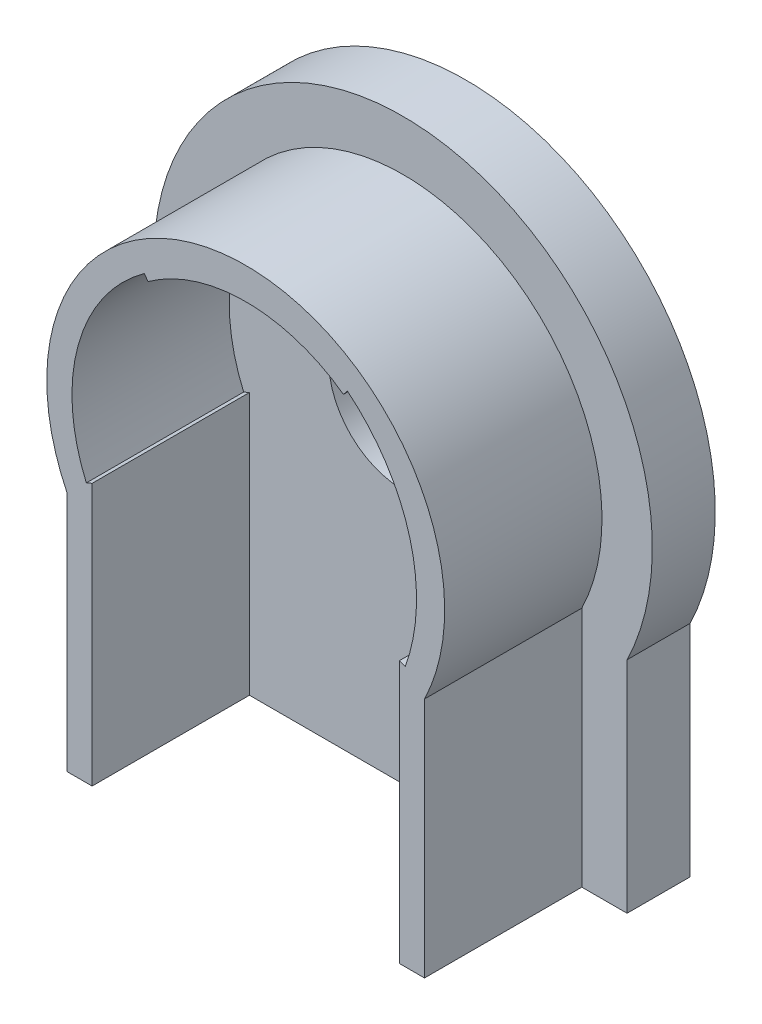
ISO-10303-21;
HEADER;
FILE_DESCRIPTION(('STEP AP214'),'2;1');
FILE_NAME('part.step','',(''),(''),'','','');
FILE_SCHEMA(('AUTOMOTIVE_DESIGN { 1 0 10303 214 1 1 1 1 }'));
ENDSEC;
DATA;
#1=APPLICATION_CONTEXT('core data for automotive mechanical design processes');
#2=APPLICATION_PROTOCOL_DEFINITION('international standard','automotive_design',2000,#1);
#3=PRODUCT_CONTEXT('',#1,'mechanical');
#4=PRODUCT('Part','Part','',(#3));
#5=PRODUCT_RELATED_PRODUCT_CATEGORY('part','',(#4));
#6=PRODUCT_DEFINITION_FORMATION('','',#4);
#7=PRODUCT_DEFINITION_CONTEXT('part definition',#1,'design');
#8=PRODUCT_DEFINITION('design','',#6,#7);
#9=PRODUCT_DEFINITION_SHAPE('','',#8);
#10=(LENGTH_UNIT() NAMED_UNIT(*) SI_UNIT(.MILLI.,.METRE.));
#11=(NAMED_UNIT(*) PLANE_ANGLE_UNIT() SI_UNIT($,.RADIAN.));
#12=(NAMED_UNIT(*) SI_UNIT($,.STERADIAN.) SOLID_ANGLE_UNIT());
#13=UNCERTAINTY_MEASURE_WITH_UNIT(LENGTH_MEASURE(1.E-05),#10,'distance_accuracy_value','');
#14=(GEOMETRIC_REPRESENTATION_CONTEXT(3) GLOBAL_UNCERTAINTY_ASSIGNED_CONTEXT((#13)) GLOBAL_UNIT_ASSIGNED_CONTEXT((#10,
#11,#12)) REPRESENTATION_CONTEXT('',''));
#15=CARTESIAN_POINT('',(0.,0.,0.));
#16=DIRECTION('',(0.,0.,1.));
#17=DIRECTION('',(1.,0.,0.));
#18=AXIS2_PLACEMENT_3D('',#15,#16,#17);
#19=CARTESIAN_POINT('',(9.02,0.,7.9375));
#20=DIRECTION('',(-1.,0.,0.));
#21=DIRECTION('',(0.,0.,1.));
#22=AXIS2_PLACEMENT_3D('',#19,#20,#21);
#23=PLANE('',#22);
#24=DIRECTION('',(0.,1.,0.));
#25=VECTOR('',#24,1.);
#26=CARTESIAN_POINT('',(9.02,0.,0.));
#27=LINE('',#26,#25);
#28=CARTESIAN_POINT('',(9.02,-16.5939489974442,0.));
#29=VERTEX_POINT('',#28);
#30=CARTESIAN_POINT('',(9.02,-4.4019489974442,0.));
#31=VERTEX_POINT('',#30);
#32=EDGE_CURVE('E283',#29,#31,#27,.T.);
#33=ORIENTED_EDGE('',*,*,#32,.T.);
#34=DIRECTION('',(0.,0.,-1.));
#35=VECTOR('',#34,1.);
#36=CARTESIAN_POINT('',(9.02,-4.4019489974442,7.9375));
#37=LINE('',#36,#35);
#38=CARTESIAN_POINT('',(9.02,-4.4019489974442,7.9375));
#39=VERTEX_POINT('',#38);
#40=EDGE_CURVE('E11',#39,#31,#37,.T.);
#41=ORIENTED_EDGE('',*,*,#40,.F.);
#42=DIRECTION('',(0.,1.,0.));
#43=VECTOR('',#42,1.);
#44=CARTESIAN_POINT('',(9.02,0.,7.9375));
#45=LINE('',#44,#43);
#46=CARTESIAN_POINT('',(9.02,-16.5939489974442,7.9375));
#47=VERTEX_POINT('',#46);
#48=EDGE_CURVE('E290',#47,#39,#45,.T.);
#49=ORIENTED_EDGE('',*,*,#48,.F.);
#50=DIRECTION('',(0.,0.,-1.));
#51=VECTOR('',#50,1.);
#52=CARTESIAN_POINT('',(9.02,-16.5939489974442,7.9375));
#53=LINE('',#52,#51);
#54=EDGE_CURVE('E311',#47,#29,#53,.T.);
#55=ORIENTED_EDGE('',*,*,#54,.T.);
#56=EDGE_LOOP('',(#33,#41,#49,#55));
#57=FACE_BOUND('',#56,.T.);
#58=ADVANCED_FACE('F34',(#57),#23,.F.);
#59=CARTESIAN_POINT('',(0.,0.,7.9375));
#60=DIRECTION('',(0.,0.,-1.));
#61=DIRECTION('',(-1.,0.,0.));
#62=AXIS2_PLACEMENT_3D('',#59,#60,#61);
#63=CYLINDRICAL_SURFACE('',#62,10.03681);
#64=CARTESIAN_POINT('',(0.,0.,0.));
#65=DIRECTION('',(0.,0.,1.));
#66=DIRECTION('',(1.,0.,0.));
#67=AXIS2_PLACEMENT_3D('',#64,#65,#66);
#68=CIRCLE('',#67,10.03681);
#69=CARTESIAN_POINT('',(-9.02,-4.4019489974442,0.));
#70=VERTEX_POINT('',#69);
#71=EDGE_CURVE('E314',#31,#70,#68,.T.);
#72=ORIENTED_EDGE('',*,*,#71,.T.);
#73=DIRECTION('',(0.,0.,-1.));
#74=VECTOR('',#73,1.);
#75=CARTESIAN_POINT('',(-9.02,-4.4019489974442,7.9375));
#76=LINE('',#75,#74);
#77=CARTESIAN_POINT('',(-9.02,-4.4019489974442,7.9375));
#78=VERTEX_POINT('',#77);
#79=EDGE_CURVE('E42',#78,#70,#76,.T.);
#80=ORIENTED_EDGE('',*,*,#79,.F.);
#81=CARTESIAN_POINT('',(0.,0.,7.9375));
#82=DIRECTION('',(0.,0.,1.));
#83=DIRECTION('',(1.,0.,0.));
#84=AXIS2_PLACEMENT_3D('',#81,#82,#83);
#85=CIRCLE('',#84,10.03681);
#86=EDGE_CURVE('E292',#39,#78,#85,.T.);
#87=ORIENTED_EDGE('',*,*,#86,.F.);
#88=ORIENTED_EDGE('',*,*,#40,.T.);
#89=EDGE_LOOP('',(#72,#80,#87,#88));
#90=FACE_BOUND('',#89,.T.);
#91=ADVANCED_FACE('F350',(#90),#63,.T.);
#92=CARTESIAN_POINT('',(-9.02,0.,7.9375));
#93=DIRECTION('',(-1.,0.,0.));
#94=DIRECTION('',(0.,-1.,0.));
#95=AXIS2_PLACEMENT_3D('',#92,#93,#94);
#96=PLANE('',#95);
#97=DIRECTION('',(0.,1.,0.));
#98=VECTOR('',#97,1.);
#99=CARTESIAN_POINT('',(-9.02,0.,0.));
#100=LINE('',#99,#98);
#101=CARTESIAN_POINT('',(-9.02,-16.5939489974442,0.));
#102=VERTEX_POINT('',#101);
#103=EDGE_CURVE('E317',#102,#70,#100,.T.);
#104=ORIENTED_EDGE('',*,*,#103,.F.);
#105=DIRECTION('',(0.,0.,-1.));
#106=VECTOR('',#105,1.);
#107=CARTESIAN_POINT('',(-9.02,-16.5939489974442,7.9375));
#108=LINE('',#107,#106);
#109=CARTESIAN_POINT('',(-9.02,-16.5939489974442,7.9375));
#110=VERTEX_POINT('',#109);
#111=EDGE_CURVE('E341',#110,#102,#108,.T.);
#112=ORIENTED_EDGE('',*,*,#111,.F.);
#113=DIRECTION('',(0.,1.,0.));
#114=VECTOR('',#113,1.);
#115=CARTESIAN_POINT('',(-9.02,0.,7.9375));
#116=LINE('',#115,#114);
#117=EDGE_CURVE('E295',#110,#78,#116,.T.);
#118=ORIENTED_EDGE('',*,*,#117,.T.);
#119=ORIENTED_EDGE('',*,*,#79,.T.);
#120=EDGE_LOOP('',(#104,#112,#118,#119));
#121=FACE_BOUND('',#120,.T.);
#122=ADVANCED_FACE('F347',(#121),#96,.T.);
#123=CARTESIAN_POINT('',(-7.75,0.,7.9375));
#124=DIRECTION('',(-1.,0.,0.));
#125=DIRECTION('',(0.,-1.,0.));
#126=AXIS2_PLACEMENT_3D('',#123,#124,#125);
#127=PLANE('',#126);
#128=DIRECTION('',(0.,1.,0.));
#129=VECTOR('',#128,1.);
#130=CARTESIAN_POINT('',(-7.75,0.,0.));
#131=LINE('',#130,#129);
#132=CARTESIAN_POINT('',(-7.75,-16.5939489974442,0.));
#133=VERTEX_POINT('',#132);
#134=CARTESIAN_POINT('',(-7.75,-3.36575986607779,0.));
#135=VERTEX_POINT('',#134);
#136=EDGE_CURVE('E320',#133,#135,#131,.T.);
#137=ORIENTED_EDGE('',*,*,#136,.T.);
#138=DIRECTION('',(0.,0.,-1.));
#139=VECTOR('',#138,1.);
#140=CARTESIAN_POINT('',(-7.75,-3.36575986607779,7.9375));
#141=LINE('',#140,#139);
#142=CARTESIAN_POINT('',(-7.75,-3.36575986607779,7.9375));
#143=VERTEX_POINT('',#142);
#144=EDGE_CURVE('E336',#143,#135,#141,.T.);
#145=ORIENTED_EDGE('',*,*,#144,.F.);
#146=DIRECTION('',(0.,1.,0.));
#147=VECTOR('',#146,1.);
#148=CARTESIAN_POINT('',(-7.75,0.,7.9375));
#149=LINE('',#148,#147);
#150=CARTESIAN_POINT('',(-7.75,-16.5939489974442,7.9375));
#151=VERTEX_POINT('',#150);
#152=EDGE_CURVE('E301',#151,#143,#149,.T.);
#153=ORIENTED_EDGE('',*,*,#152,.F.);
#154=DIRECTION('',(0.,0.,-1.));
#155=VECTOR('',#154,1.);
#156=CARTESIAN_POINT('',(-7.75,-16.5939489974442,7.9375));
#157=LINE('',#156,#155);
#158=EDGE_CURVE('E338',#151,#133,#157,.T.);
#159=ORIENTED_EDGE('',*,*,#158,.T.);
#160=EDGE_LOOP('',(#137,#145,#153,#159));
#161=FACE_BOUND('',#160,.T.);
#162=ADVANCED_FACE('F398',(#161),#127,.F.);
#163=CARTESIAN_POINT('',(0.,0.,7.9375));
#164=DIRECTION('',(0.,0.,-1.));
#165=DIRECTION('',(-1.,0.,0.));
#166=AXIS2_PLACEMENT_3D('',#163,#164,#165);
#167=CYLINDRICAL_SURFACE('',#166,8.44931);
#168=DIRECTION('',(0.,0.,1.));
#169=VECTOR('',#168,1.);
#170=CARTESIAN_POINT('',(-4.93015243172055,6.86181,-11.284156350079));
#171=LINE('',#170,#169);
#172=CARTESIAN_POINT('',(-4.93015243172055,6.86181,0.));
#173=VERTEX_POINT('',#172);
#174=CARTESIAN_POINT('',(-4.93015243172055,6.86181,7.9375));
#175=VERTEX_POINT('',#174);
#176=EDGE_CURVE('E228',#173,#175,#171,.T.);
#177=ORIENTED_EDGE('',*,*,#176,.F.);
#178=CARTESIAN_POINT('',(0.,0.,0.));
#179=DIRECTION('',(0.,0.,1.));
#180=DIRECTION('',(1.,0.,0.));
#181=AXIS2_PLACEMENT_3D('',#178,#179,#180);
#182=CIRCLE('',#181,8.44931);
#183=CARTESIAN_POINT('',(4.93015243172055,6.86181,0.));
#184=VERTEX_POINT('',#183);
#185=EDGE_CURVE('E323',#184,#173,#182,.T.);
#186=ORIENTED_EDGE('',*,*,#185,.F.);
#187=DIRECTION('',(0.,0.,1.));
#188=VECTOR('',#187,1.);
#189=CARTESIAN_POINT('',(4.93015243172055,6.86181,-11.284156350079));
#190=LINE('',#189,#188);
#191=CARTESIAN_POINT('',(4.93015243172055,6.86181,7.9375));
#192=VERTEX_POINT('',#191);
#193=EDGE_CURVE('E236',#184,#192,#190,.T.);
#194=ORIENTED_EDGE('',*,*,#193,.T.);
#195=CARTESIAN_POINT('',(0.,0.,7.9375));
#196=DIRECTION('',(0.,0.,1.));
#197=DIRECTION('',(1.,0.,0.));
#198=AXIS2_PLACEMENT_3D('',#195,#196,#197);
#199=CIRCLE('',#198,8.44931);
#200=EDGE_CURVE('E304',#192,#175,#199,.T.);
#201=ORIENTED_EDGE('',*,*,#200,.T.);
#202=EDGE_LOOP('',(#177,#186,#194,#201));
#203=FACE_BOUND('',#202,.T.);
#204=ADVANCED_FACE('F403',(#203),#167,.F.);
#205=CARTESIAN_POINT('',(7.75,0.,7.9375));
#206=DIRECTION('',(-1.,0.,0.));
#207=DIRECTION('',(0.,-1.,0.));
#208=AXIS2_PLACEMENT_3D('',#205,#206,#207);
#209=PLANE('',#208);
#210=DIRECTION('',(0.,1.,0.));
#211=VECTOR('',#210,1.);
#212=CARTESIAN_POINT('',(7.75,0.,0.));
#213=LINE('',#212,#211);
#214=CARTESIAN_POINT('',(7.75,-16.5939489974442,0.));
#215=VERTEX_POINT('',#214);
#216=CARTESIAN_POINT('',(7.75,-3.36575986607779,0.));
#217=VERTEX_POINT('',#216);
#218=EDGE_CURVE('E293',#215,#217,#213,.T.);
#219=ORIENTED_EDGE('',*,*,#218,.F.);
#220=DIRECTION('',(0.,0.,-1.));
#221=VECTOR('',#220,1.);
#222=CARTESIAN_POINT('',(7.75,-16.5939489974442,7.9375));
#223=LINE('',#222,#221);
#224=CARTESIAN_POINT('',(7.75,-16.5939489974442,7.9375));
#225=VERTEX_POINT('',#224);
#226=EDGE_CURVE('E330',#225,#215,#223,.T.);
#227=ORIENTED_EDGE('',*,*,#226,.F.);
#228=DIRECTION('',(0.,1.,0.));
#229=VECTOR('',#228,1.);
#230=CARTESIAN_POINT('',(7.75,0.,7.9375));
#231=LINE('',#230,#229);
#232=CARTESIAN_POINT('',(7.75,-3.36575986607779,7.9375));
#233=VERTEX_POINT('',#232);
#234=EDGE_CURVE('E307',#225,#233,#231,.T.);
#235=ORIENTED_EDGE('',*,*,#234,.T.);
#236=DIRECTION('',(0.,0.,-1.));
#237=VECTOR('',#236,1.);
#238=CARTESIAN_POINT('',(7.75,-3.36575986607779,7.9375));
#239=LINE('',#238,#237);
#240=EDGE_CURVE('E333',#233,#217,#239,.T.);
#241=ORIENTED_EDGE('',*,*,#240,.T.);
#242=EDGE_LOOP('',(#219,#227,#235,#241));
#243=FACE_BOUND('',#242,.T.);
#244=ADVANCED_FACE('F407',(#243),#209,.T.);
#245=CARTESIAN_POINT('',(0.,-16.5939489974442,7.9375));
#246=DIRECTION('',(0.,1.,0.));
#247=DIRECTION('',(0.,0.,1.));
#248=AXIS2_PLACEMENT_3D('',#245,#246,#247);
#249=PLANE('',#248);
#250=ORIENTED_EDGE('',*,*,#226,.T.);
#251=DIRECTION('',(-1.,0.,0.));
#252=VECTOR('',#251,1.);
#253=CARTESIAN_POINT('',(0.,-16.5939489974442,0.));
#254=LINE('',#253,#252);
#255=EDGE_CURVE('E270',#215,#133,#254,.T.);
#256=ORIENTED_EDGE('',*,*,#255,.T.);
#257=ORIENTED_EDGE('',*,*,#158,.F.);
#258=DIRECTION('',(-1.,0.,0.));
#259=VECTOR('',#258,1.);
#260=CARTESIAN_POINT('',(0.,-16.5939489974442,7.9375));
#261=LINE('',#260,#259);
#262=EDGE_CURVE('E298',#151,#110,#261,.T.);
#263=ORIENTED_EDGE('',*,*,#262,.T.);
#264=ORIENTED_EDGE('',*,*,#111,.T.);
#265=CARTESIAN_POINT('',(-11.3026774642541,-16.5939489974442,0.));
#266=VERTEX_POINT('',#265);
#267=EDGE_CURVE('E234',#102,#266,#254,.T.);
#268=ORIENTED_EDGE('',*,*,#267,.T.);
#269=DIRECTION('',(0.,0.,1.));
#270=VECTOR('',#269,1.);
#271=CARTESIAN_POINT('',(-11.3026774642541,-16.5939489974442,-3.175));
#272=LINE('',#271,#270);
#273=CARTESIAN_POINT('',(-11.3026774642541,-16.5939489974442,-3.175));
#274=VERTEX_POINT('',#273);
#275=EDGE_CURVE('E280',#274,#266,#272,.T.);
#276=ORIENTED_EDGE('',*,*,#275,.F.);
#277=DIRECTION('',(-1.,0.,0.));
#278=VECTOR('',#277,1.);
#279=CARTESIAN_POINT('',(0.,-16.5939489974442,-3.175));
#280=LINE('',#279,#278);
#281=CARTESIAN_POINT('',(11.3026774642541,-16.5939489974442,-3.175));
#282=VERTEX_POINT('',#281);
#283=EDGE_CURVE('E251',#282,#274,#280,.T.);
#284=ORIENTED_EDGE('',*,*,#283,.F.);
#285=DIRECTION('',(0.,0.,1.));
#286=VECTOR('',#285,1.);
#287=CARTESIAN_POINT('',(11.3026774642541,-16.5939489974442,-3.175));
#288=LINE('',#287,#286);
#289=CARTESIAN_POINT('',(11.3026774642541,-16.5939489974442,0.));
#290=VERTEX_POINT('',#289);
#291=EDGE_CURVE('E265',#282,#290,#288,.T.);
#292=ORIENTED_EDGE('',*,*,#291,.T.);
#293=EDGE_CURVE('E266',#290,#29,#254,.T.);
#294=ORIENTED_EDGE('',*,*,#293,.T.);
#295=ORIENTED_EDGE('',*,*,#54,.F.);
#296=DIRECTION('',(1.,0.,0.));
#297=VECTOR('',#296,1.);
#298=CARTESIAN_POINT('',(0.,-16.5939489974442,7.9375));
#299=LINE('',#298,#297);
#300=EDGE_CURVE('E49',#225,#47,#299,.T.);
#301=ORIENTED_EDGE('',*,*,#300,.F.);
#302=EDGE_LOOP('',(#250,#256,#257,#263,#264,#268,#276,#284,#292,#294,#295,#301));
#303=FACE_BOUND('',#302,.T.);
#304=ADVANCED_FACE('F358',(#303),#249,.F.);
#305=CARTESIAN_POINT('',(0.,0.,7.9375));
#306=DIRECTION('',(0.,0.,1.));
#307=DIRECTION('',(1.,0.,0.));
#308=AXIS2_PLACEMENT_3D('',#305,#306,#307);
#309=PLANE('',#308);
#310=DIRECTION('',(0.917234661765286,0.398347304818699,0.));
#311=VECTOR('',#310,1.);
#312=CARTESIAN_POINT('',(-8.04122200511048,-3.49223513535773,7.9375));
#313=LINE('',#312,#311);
#314=CARTESIAN_POINT('',(-8.04122200511048,-3.49223513535773,7.9375));
#315=VERTEX_POINT('',#314);
#316=EDGE_CURVE('E226',#315,#143,#313,.T.);
#317=ORIENTED_EDGE('',*,*,#316,.F.);
#318=CARTESIAN_POINT('',(0.,0.,7.9375));
#319=DIRECTION('',(0.,0.,1.));
#320=DIRECTION('',(-1.,0.,0.));
#321=AXIS2_PLACEMENT_3D('',#318,#319,#320);
#322=CIRCLE('',#321,8.76681000000001);
#323=CARTESIAN_POINT('',(-5.1154129319355,7.1196564602435,7.9375));
#324=VERTEX_POINT('',#323);
#325=EDGE_CURVE('E222',#324,#315,#322,.T.);
#326=ORIENTED_EDGE('',*,*,#325,.F.);
#327=DIRECTION('',(-0.583497638472317,0.812114835412597,0.));
#328=VECTOR('',#327,1.);
#329=CARTESIAN_POINT('',(-4.93015243172055,6.86181,7.9375));
#330=LINE('',#329,#328);
#331=EDGE_CURVE('E219',#175,#324,#330,.T.);
#332=ORIENTED_EDGE('',*,*,#331,.F.);
#333=ORIENTED_EDGE('',*,*,#200,.F.);
#334=DIRECTION('',(-0.632527621931283,-0.774537802495112,0.));
#335=VECTOR('',#334,1.);
#336=CARTESIAN_POINT('',(4.93015243172055,6.86181,7.9375));
#337=LINE('',#336,#335);
#338=CARTESIAN_POINT('',(5.13097995168373,7.1077257522922,7.9375));
#339=VERTEX_POINT('',#338);
#340=EDGE_CURVE('E243',#339,#192,#337,.T.);
#341=ORIENTED_EDGE('',*,*,#340,.F.);
#342=CARTESIAN_POINT('',(-0.869283869452584,-0.239670619464608,7.9375));
#343=DIRECTION('',(0.,0.,1.));
#344=DIRECTION('',(1.,0.,0.));
#345=AXIS2_PLACEMENT_3D('',#342,#343,#344);
#346=CIRCLE('',#345,9.48616884558473);
#347=CARTESIAN_POINT('',(8.04847545752174,-3.47401258547638,7.9375));
#348=VERTEX_POINT('',#347);
#349=EDGE_CURVE('E240',#348,#339,#346,.T.);
#350=ORIENTED_EDGE('',*,*,#349,.F.);
#351=DIRECTION('',(0.940080181170823,-0.340953446924697,0.));
#352=VECTOR('',#351,1.);
#353=CARTESIAN_POINT('',(7.75,-3.36575986607779,7.9375));
#354=LINE('',#353,#352);
#355=EDGE_CURVE('E211',#233,#348,#354,.T.);
#356=ORIENTED_EDGE('',*,*,#355,.F.);
#357=ORIENTED_EDGE('',*,*,#234,.F.);
#358=ORIENTED_EDGE('',*,*,#300,.T.);
#359=ORIENTED_EDGE('',*,*,#48,.T.);
#360=ORIENTED_EDGE('',*,*,#86,.T.);
#361=ORIENTED_EDGE('',*,*,#117,.F.);
#362=ORIENTED_EDGE('',*,*,#262,.F.);
#363=ORIENTED_EDGE('',*,*,#152,.T.);
#364=EDGE_LOOP('',(#317,#326,#332,#333,#341,#350,#356,#357,#358,#359,#360,#361,#362,#363));
#365=FACE_BOUND('',#364,.T.);
#366=ADVANCED_FACE('F361',(#365),#309,.T.);
#367=CARTESIAN_POINT('',(0.,0.,0.));
#368=DIRECTION('',(0.,0.,1.));
#369=DIRECTION('',(1.,0.,0.));
#370=AXIS2_PLACEMENT_3D('',#367,#368,#369);
#371=PLANE('',#370);
#372=DIRECTION('',(0.940080181170825,-0.340953446924691,0.));
#373=VECTOR('',#372,1.);
#374=CARTESIAN_POINT('',(6.85457362743479,-3.04100170788202,0.));
#375=LINE('',#374,#373);
#376=CARTESIAN_POINT('',(6.85457362743479,-3.04100170788202,0.));
#377=VERTEX_POINT('',#376);
#378=EDGE_CURVE('E198',#377,#217,#375,.T.);
#379=ORIENTED_EDGE('',*,*,#378,.F.);
#380=CARTESIAN_POINT('',(-0.869283869452673,-0.239670619464606,0.));
#381=DIRECTION('',(0.,0.,-1.));
#382=DIRECTION('',(1.,0.,0.));
#383=AXIS2_PLACEMENT_3D('',#380,#381,#382);
#384=CIRCLE('',#383,8.21616884558482);
#385=CARTESIAN_POINT('',(7.05135009260387,1.94413068520464,0.));
#386=VERTEX_POINT('',#385);
#387=EDGE_CURVE('E200',#386,#377,#384,.T.);
#388=ORIENTED_EDGE('',*,*,#387,.F.);
#389=DIRECTION('',(-0.964030086396399,-0.265793138591933,0.));
#390=VECTOR('',#389,1.);
#391=CARTESIAN_POINT('',(7.05135009260387,1.94413068520464,0.));
#392=LINE('',#391,#390);
#393=CARTESIAN_POINT('',(8.2756683023273,2.28168797121639,0.));
#394=VERTEX_POINT('',#393);
#395=EDGE_CURVE('E205',#394,#386,#392,.T.);
#396=ORIENTED_EDGE('',*,*,#395,.F.);
#397=CARTESIAN_POINT('',(-0.869283869452584,-0.239670619464608,0.));
#398=DIRECTION('',(0.,0.,1.));
#399=DIRECTION('',(1.,0.,0.));
#400=AXIS2_PLACEMENT_3D('',#397,#398,#399);
#401=CIRCLE('',#400,9.48616884558473);
#402=CARTESIAN_POINT('',(5.13097995168373,7.1077257522922,0.));
#403=VERTEX_POINT('',#402);
#404=EDGE_CURVE('E181',#403,#394,#401,.F.);
#405=ORIENTED_EDGE('',*,*,#404,.F.);
#406=DIRECTION('',(0.632527621931283,0.774537802495112,0.));
#407=VECTOR('',#406,1.);
#408=CARTESIAN_POINT('',(4.93015243172055,6.86181,0.));
#409=LINE('',#408,#407);
#410=EDGE_CURVE('E223',#184,#403,#409,.T.);
#411=ORIENTED_EDGE('',*,*,#410,.F.);
#412=ORIENTED_EDGE('',*,*,#185,.T.);
#413=DIRECTION('',(0.583497638472317,-0.812114835412597,0.));
#414=VECTOR('',#413,1.);
#415=CARTESIAN_POINT('',(-4.93015243172055,6.86181,0.));
#416=LINE('',#415,#414);
#417=CARTESIAN_POINT('',(-5.1154129319355,7.1196564602435,0.));
#418=VERTEX_POINT('',#417);
#419=EDGE_CURVE('E218',#418,#173,#416,.T.);
#420=ORIENTED_EDGE('',*,*,#419,.F.);
#421=CARTESIAN_POINT('',(0.,0.,0.));
#422=DIRECTION('',(0.,0.,1.));
#423=DIRECTION('',(1.,0.,0.));
#424=AXIS2_PLACEMENT_3D('',#421,#422,#423);
#425=CIRCLE('',#424,8.76681000000001);
#426=CARTESIAN_POINT('',(-8.04122200511048,-3.49223513535773,0.));
#427=VERTEX_POINT('',#426);
#428=EDGE_CURVE('E213',#427,#418,#425,.F.);
#429=ORIENTED_EDGE('',*,*,#428,.F.);
#430=DIRECTION('',(-0.917234661765286,-0.398347304818699,0.));
#431=VECTOR('',#430,1.);
#432=CARTESIAN_POINT('',(-8.04122200511048,-3.49223513535773,0.));
#433=LINE('',#432,#431);
#434=EDGE_CURVE('E215',#135,#427,#433,.T.);
#435=ORIENTED_EDGE('',*,*,#434,.F.);
#436=ORIENTED_EDGE('',*,*,#136,.F.);
#437=ORIENTED_EDGE('',*,*,#255,.F.);
#438=ORIENTED_EDGE('',*,*,#218,.T.);
#439=EDGE_LOOP('',(#379,#388,#396,#405,#411,#412,#420,#429,#435,#436,#437,#438));
#440=FACE_BOUND('',#439,.T.);
#441=CARTESIAN_POINT('',(0.,0.,0.));
#442=DIRECTION('',(0.,0.,1.));
#443=DIRECTION('',(1.,0.,0.));
#444=AXIS2_PLACEMENT_3D('',#441,#442,#443);
#445=CIRCLE('',#444,3.75);
#446=CARTESIAN_POINT('',(3.75,0.,0.));
#447=VERTEX_POINT('',#446);
#448=EDGE_CURVE('E254',#447,#447,#445,.T.);
#449=ORIENTED_EDGE('',*,*,#448,.F.);
#450=EDGE_LOOP('',(#449));
#451=FACE_BOUND('',#450,.T.);
#452=ADVANCED_FACE('F414',(#440,#451),#371,.T.);
#453=CARTESIAN_POINT('',(-11.3026774642541,0.,-3.175));
#454=DIRECTION('',(-1.,0.,0.));
#455=DIRECTION('',(0.,-1.,0.));
#456=AXIS2_PLACEMENT_3D('',#453,#454,#455);
#457=PLANE('',#456);
#458=DIRECTION('',(0.,-1.,0.));
#459=VECTOR('',#458,1.);
#460=CARTESIAN_POINT('',(-11.3026774642541,0.,0.));
#461=LINE('',#460,#459);
#462=CARTESIAN_POINT('',(-11.3026774642541,-5.5159434292914,0.));
#463=VERTEX_POINT('',#462);
#464=EDGE_CURVE('E275',#463,#266,#461,.T.);
#465=ORIENTED_EDGE('',*,*,#464,.F.);
#466=DIRECTION('',(0.,0.,1.));
#467=VECTOR('',#466,1.);
#468=CARTESIAN_POINT('',(-11.3026774642541,-5.5159434292914,-3.175));
#469=LINE('',#468,#467);
#470=CARTESIAN_POINT('',(-11.3026774642541,-5.5159434292914,-3.175));
#471=VERTEX_POINT('',#470);
#472=EDGE_CURVE('E284',#471,#463,#469,.T.);
#473=ORIENTED_EDGE('',*,*,#472,.F.);
#474=DIRECTION('',(0.,-1.,0.));
#475=VECTOR('',#474,1.);
#476=CARTESIAN_POINT('',(-11.3026774642541,0.,-3.175));
#477=LINE('',#476,#475);
#478=EDGE_CURVE('E259',#471,#274,#477,.T.);
#479=ORIENTED_EDGE('',*,*,#478,.T.);
#480=ORIENTED_EDGE('',*,*,#275,.T.);
#481=EDGE_LOOP('',(#465,#473,#479,#480));
#482=FACE_BOUND('',#481,.T.);
#483=ADVANCED_FACE('F375',(#482),#457,.T.);
#484=CARTESIAN_POINT('',(0.,0.,-3.175));
#485=DIRECTION('',(0.,0.,1.));
#486=DIRECTION('',(1.,0.,0.));
#487=AXIS2_PLACEMENT_3D('',#484,#485,#486);
#488=CYLINDRICAL_SURFACE('',#487,12.57681);
#489=CARTESIAN_POINT('',(0.,0.,0.));
#490=DIRECTION('',(0.,0.,1.));
#491=DIRECTION('',(1.,0.,0.));
#492=AXIS2_PLACEMENT_3D('',#489,#490,#491);
#493=CIRCLE('',#492,12.57681);
#494=CARTESIAN_POINT('',(11.3026774642541,-5.5159434292914,0.));
#495=VERTEX_POINT('',#494);
#496=EDGE_CURVE('E272',#495,#463,#493,.T.);
#497=ORIENTED_EDGE('',*,*,#496,.F.);
#498=DIRECTION('',(0.,0.,1.));
#499=VECTOR('',#498,1.);
#500=CARTESIAN_POINT('',(11.3026774642541,-5.5159434292914,-3.175));
#501=LINE('',#500,#499);
#502=CARTESIAN_POINT('',(11.3026774642541,-5.5159434292914,-3.175));
#503=VERTEX_POINT('',#502);
#504=EDGE_CURVE('E286',#503,#495,#501,.T.);
#505=ORIENTED_EDGE('',*,*,#504,.F.);
#506=CARTESIAN_POINT('',(0.,0.,-3.175));
#507=DIRECTION('',(0.,0.,1.));
#508=DIRECTION('',(1.,0.,0.));
#509=AXIS2_PLACEMENT_3D('',#506,#507,#508);
#510=CIRCLE('',#509,12.57681);
#511=EDGE_CURVE('E256',#503,#471,#510,.T.);
#512=ORIENTED_EDGE('',*,*,#511,.T.);
#513=ORIENTED_EDGE('',*,*,#472,.T.);
#514=EDGE_LOOP('',(#497,#505,#512,#513));
#515=FACE_BOUND('',#514,.T.);
#516=ADVANCED_FACE('F370',(#515),#488,.T.);
#517=CARTESIAN_POINT('',(11.3026774642541,0.,-3.175));
#518=DIRECTION('',(-1.,0.,0.));
#519=DIRECTION('',(0.,-1.,0.));
#520=AXIS2_PLACEMENT_3D('',#517,#518,#519);
#521=PLANE('',#520);
#522=DIRECTION('',(0.,-1.,0.));
#523=VECTOR('',#522,1.);
#524=CARTESIAN_POINT('',(11.3026774642541,0.,0.));
#525=LINE('',#524,#523);
#526=EDGE_CURVE('E269',#495,#290,#525,.T.);
#527=ORIENTED_EDGE('',*,*,#526,.T.);
#528=ORIENTED_EDGE('',*,*,#291,.F.);
#529=DIRECTION('',(0.,-1.,0.));
#530=VECTOR('',#529,1.);
#531=CARTESIAN_POINT('',(11.3026774642541,0.,-3.175));
#532=LINE('',#531,#530);
#533=EDGE_CURVE('E253',#503,#282,#532,.T.);
#534=ORIENTED_EDGE('',*,*,#533,.F.);
#535=ORIENTED_EDGE('',*,*,#504,.T.);
#536=EDGE_LOOP('',(#527,#528,#534,#535));
#537=FACE_BOUND('',#536,.T.);
#538=ADVANCED_FACE('F379',(#537),#521,.F.);
#539=CARTESIAN_POINT('',(0.,0.,-3.175));
#540=DIRECTION('',(0.,0.,1.));
#541=DIRECTION('',(1.,0.,0.));
#542=AXIS2_PLACEMENT_3D('',#539,#540,#541);
#543=CYLINDRICAL_SURFACE('',#542,3.75);
#544=CARTESIAN_POINT('',(0.,0.,-3.175));
#545=DIRECTION('',(0.,0.,1.));
#546=DIRECTION('',(1.,0.,0.));
#547=AXIS2_PLACEMENT_3D('',#544,#545,#546);
#548=CIRCLE('',#547,3.75);
#549=CARTESIAN_POINT('',(3.75,0.,-3.175));
#550=VERTEX_POINT('',#549);
#551=EDGE_CURVE('E262',#550,#550,#548,.T.);
#552=ORIENTED_EDGE('',*,*,#551,.F.);
#553=EDGE_LOOP('',(#552));
#554=FACE_BOUND('',#553,.T.);
#555=ORIENTED_EDGE('',*,*,#448,.T.);
#556=EDGE_LOOP('',(#555));
#557=FACE_BOUND('',#556,.T.);
#558=ADVANCED_FACE('F381',(#554,#557),#543,.F.);
#559=CARTESIAN_POINT('',(0.,0.,-3.175));
#560=DIRECTION('',(0.,0.,1.));
#561=DIRECTION('',(1.,0.,0.));
#562=AXIS2_PLACEMENT_3D('',#559,#560,#561);
#563=PLANE('',#562);
#564=ORIENTED_EDGE('',*,*,#283,.T.);
#565=ORIENTED_EDGE('',*,*,#478,.F.);
#566=ORIENTED_EDGE('',*,*,#511,.F.);
#567=ORIENTED_EDGE('',*,*,#533,.T.);
#568=EDGE_LOOP('',(#564,#565,#566,#567));
#569=FACE_BOUND('',#568,.T.);
#570=ORIENTED_EDGE('',*,*,#551,.T.);
#571=EDGE_LOOP('',(#570));
#572=FACE_BOUND('',#571,.T.);
#573=ADVANCED_FACE('F377',(#569,#572),#563,.F.);
#574=ORIENTED_EDGE('',*,*,#32,.F.);
#575=ORIENTED_EDGE('',*,*,#293,.F.);
#576=ORIENTED_EDGE('',*,*,#526,.F.);
#577=ORIENTED_EDGE('',*,*,#496,.T.);
#578=ORIENTED_EDGE('',*,*,#464,.T.);
#579=ORIENTED_EDGE('',*,*,#267,.F.);
#580=ORIENTED_EDGE('',*,*,#103,.T.);
#581=ORIENTED_EDGE('',*,*,#71,.F.);
#582=EDGE_LOOP('',(#574,#575,#576,#577,#578,#579,#580,#581));
#583=FACE_BOUND('',#582,.T.);
#584=ADVANCED_FACE('F353',(#583),#371,.T.);
#585=CARTESIAN_POINT('',(-8.04122200511048,-3.49223513535773,-11.284156350079));
#586=DIRECTION('',(0.398347304818699,-0.917234661765286,0.));
#587=DIRECTION('',(0.917234661765286,0.398347304818699,0.));
#588=AXIS2_PLACEMENT_3D('',#585,#586,#587);
#589=PLANE('',#588);
#590=ORIENTED_EDGE('',*,*,#434,.T.);
#591=DIRECTION('',(0.,0.,1.));
#592=VECTOR('',#591,1.);
#593=CARTESIAN_POINT('',(-8.04122200511048,-3.49223513535773,-11.284156350079));
#594=LINE('',#593,#592);
#595=EDGE_CURVE('E216',#427,#315,#594,.T.);
#596=ORIENTED_EDGE('',*,*,#595,.T.);
#597=ORIENTED_EDGE('',*,*,#316,.T.);
#598=ORIENTED_EDGE('',*,*,#144,.T.);
#599=EDGE_LOOP('',(#590,#596,#597,#598));
#600=FACE_BOUND('',#599,.T.);
#601=ADVANCED_FACE('F428',(#600),#589,.F.);
#602=CARTESIAN_POINT('',(0.,0.,-11.284156350079));
#603=DIRECTION('',(0.,0.,1.));
#604=DIRECTION('',(1.,0.,0.));
#605=AXIS2_PLACEMENT_3D('',#602,#603,#604);
#606=CYLINDRICAL_SURFACE('',#605,8.76681000000001);
#607=ORIENTED_EDGE('',*,*,#428,.T.);
#608=DIRECTION('',(0.,0.,1.));
#609=VECTOR('',#608,1.);
#610=CARTESIAN_POINT('',(-5.1154129319355,7.1196564602435,-11.284156350079));
#611=LINE('',#610,#609);
#612=EDGE_CURVE('E230',#418,#324,#611,.T.);
#613=ORIENTED_EDGE('',*,*,#612,.T.);
#614=ORIENTED_EDGE('',*,*,#325,.T.);
#615=ORIENTED_EDGE('',*,*,#595,.F.);
#616=EDGE_LOOP('',(#607,#613,#614,#615));
#617=FACE_BOUND('',#616,.T.);
#618=ADVANCED_FACE('F433',(#617),#606,.F.);
#619=CARTESIAN_POINT('',(-4.93015243172055,6.86181,-11.284156350079));
#620=DIRECTION('',(0.812114835412597,0.583497638472317,0.));
#621=DIRECTION('',(-0.583497638472317,0.812114835412597,0.));
#622=AXIS2_PLACEMENT_3D('',#619,#620,#621);
#623=PLANE('',#622);
#624=ORIENTED_EDGE('',*,*,#419,.T.);
#625=ORIENTED_EDGE('',*,*,#176,.T.);
#626=ORIENTED_EDGE('',*,*,#331,.T.);
#627=ORIENTED_EDGE('',*,*,#612,.F.);
#628=EDGE_LOOP('',(#624,#625,#626,#627));
#629=FACE_BOUND('',#628,.T.);
#630=ADVANCED_FACE('F449',(#629),#623,.F.);
#631=CARTESIAN_POINT('',(4.93015243172055,6.86181,-11.284156350079));
#632=DIRECTION('',(-0.774537802495112,0.632527621931283,0.));
#633=DIRECTION('',(-0.632527621931283,-0.774537802495112,0.));
#634=AXIS2_PLACEMENT_3D('',#631,#632,#633);
#635=PLANE('',#634);
#636=ORIENTED_EDGE('',*,*,#410,.T.);
#637=DIRECTION('',(0.,0.,1.));
#638=VECTOR('',#637,1.);
#639=CARTESIAN_POINT('',(5.13097995168373,7.1077257522922,-11.284156350079));
#640=LINE('',#639,#638);
#641=EDGE_CURVE('E248',#403,#339,#640,.T.);
#642=ORIENTED_EDGE('',*,*,#641,.T.);
#643=ORIENTED_EDGE('',*,*,#340,.T.);
#644=ORIENTED_EDGE('',*,*,#193,.F.);
#645=EDGE_LOOP('',(#636,#642,#643,#644));
#646=FACE_BOUND('',#645,.T.);
#647=ADVANCED_FACE('F446',(#646),#635,.F.);
#648=CARTESIAN_POINT('',(-0.869283869452584,-0.239670619464608,-11.284156350079));
#649=DIRECTION('',(0.,0.,1.));
#650=DIRECTION('',(1.,0.,0.));
#651=AXIS2_PLACEMENT_3D('',#648,#649,#650);
#652=CYLINDRICAL_SURFACE('',#651,9.48616884558473);
#653=ORIENTED_EDGE('',*,*,#404,.T.);
#654=DIRECTION('',(0.,0.,1.));
#655=VECTOR('',#654,1.);
#656=CARTESIAN_POINT('',(8.2756683023273,2.28168797121639,-1.7145));
#657=LINE('',#656,#655);
#658=CARTESIAN_POINT('',(8.2756683023273,2.28168797121639,-1.7145));
#659=VERTEX_POINT('',#658);
#660=EDGE_CURVE('E173',#659,#394,#657,.T.);
#661=ORIENTED_EDGE('',*,*,#660,.F.);
#662=CARTESIAN_POINT('',(-0.869283869452673,-0.239670619464606,-1.7145));
#663=DIRECTION('',(0.,0.,1.));
#664=DIRECTION('',(1.,0.,0.));
#665=AXIS2_PLACEMENT_3D('',#662,#663,#664);
#666=CIRCLE('',#665,9.48616884558482);
#667=CARTESIAN_POINT('',(8.04847545752174,-3.47401258547638,-1.7145));
#668=VERTEX_POINT('',#667);
#669=EDGE_CURVE('E177',#668,#659,#666,.T.);
#670=ORIENTED_EDGE('',*,*,#669,.F.);
#671=DIRECTION('',(0.,0.,1.));
#672=VECTOR('',#671,1.);
#673=CARTESIAN_POINT('',(8.04847545752174,-3.47401258547638,-11.284156350079));
#674=LINE('',#673,#672);
#675=EDGE_CURVE('E245',#668,#348,#674,.T.);
#676=ORIENTED_EDGE('',*,*,#675,.T.);
#677=ORIENTED_EDGE('',*,*,#349,.T.);
#678=ORIENTED_EDGE('',*,*,#641,.F.);
#679=EDGE_LOOP('',(#653,#661,#670,#676,#677,#678));
#680=FACE_BOUND('',#679,.T.);
#681=ADVANCED_FACE('F175',(#680),#652,.F.);
#682=CARTESIAN_POINT('',(7.75,-3.36575986607779,-11.284156350079));
#683=DIRECTION('',(-0.340953446924698,-0.940080181170823,0.));
#684=DIRECTION('',(0.940080181170823,-0.340953446924698,0.));
#685=AXIS2_PLACEMENT_3D('',#682,#683,#684);
#686=PLANE('',#685);
#687=ORIENTED_EDGE('',*,*,#675,.F.);
#688=DIRECTION('',(0.940080181170825,-0.340953446924691,0.));
#689=VECTOR('',#688,1.);
#690=CARTESIAN_POINT('',(6.85457362743479,-3.04100170788202,-1.7145));
#691=LINE('',#690,#689);
#692=CARTESIAN_POINT('',(6.85457362743479,-3.04100170788202,-1.7145));
#693=VERTEX_POINT('',#692);
#694=EDGE_CURVE('E186',#693,#668,#691,.T.);
#695=ORIENTED_EDGE('',*,*,#694,.F.);
#696=DIRECTION('',(0.,0.,1.));
#697=VECTOR('',#696,1.);
#698=CARTESIAN_POINT('',(6.85457362743479,-3.04100170788202,-1.7145));
#699=LINE('',#698,#697);
#700=EDGE_CURVE('E209',#693,#377,#699,.T.);
#701=ORIENTED_EDGE('',*,*,#700,.T.);
#702=ORIENTED_EDGE('',*,*,#378,.T.);
#703=ORIENTED_EDGE('',*,*,#240,.F.);
#704=ORIENTED_EDGE('',*,*,#355,.T.);
#705=EDGE_LOOP('',(#687,#695,#701,#702,#703,#704));
#706=FACE_BOUND('',#705,.T.);
#707=ADVANCED_FACE('F439',(#706),#686,.F.);
#708=CARTESIAN_POINT('',(-0.869283869452673,-0.239670619464606,-1.7145));
#709=DIRECTION('',(0.,0.,1.));
#710=DIRECTION('',(1.,0.,0.));
#711=AXIS2_PLACEMENT_3D('',#708,#709,#710);
#712=CYLINDRICAL_SURFACE('',#711,8.21616884558482);
#713=ORIENTED_EDGE('',*,*,#387,.T.);
#714=ORIENTED_EDGE('',*,*,#700,.F.);
#715=CARTESIAN_POINT('',(-0.869283869452673,-0.239670619464606,-1.7145));
#716=DIRECTION('',(0.,0.,-1.));
#717=DIRECTION('',(1.,0.,0.));
#718=AXIS2_PLACEMENT_3D('',#715,#716,#717);
#719=CIRCLE('',#718,8.21616884558482);
#720=CARTESIAN_POINT('',(7.05135009260387,1.94413068520464,-1.7145));
#721=VERTEX_POINT('',#720);
#722=EDGE_CURVE('E194',#721,#693,#719,.T.);
#723=ORIENTED_EDGE('',*,*,#722,.F.);
#724=DIRECTION('',(0.,0.,1.));
#725=VECTOR('',#724,1.);
#726=CARTESIAN_POINT('',(7.05135009260387,1.94413068520464,-1.7145));
#727=LINE('',#726,#725);
#728=EDGE_CURVE('E185',#721,#386,#727,.T.);
#729=ORIENTED_EDGE('',*,*,#728,.T.);
#730=EDGE_LOOP('',(#713,#714,#723,#729));
#731=FACE_BOUND('',#730,.T.);
#732=ADVANCED_FACE('F442',(#731),#712,.T.);
#733=CARTESIAN_POINT('',(7.05135009260387,1.94413068520464,-1.7145));
#734=DIRECTION('',(-0.265793138591933,0.964030086396399,0.));
#735=DIRECTION('',(-0.964030086396399,-0.265793138591933,0.));
#736=AXIS2_PLACEMENT_3D('',#733,#734,#735);
#737=PLANE('',#736);
#738=ORIENTED_EDGE('',*,*,#395,.T.);
#739=ORIENTED_EDGE('',*,*,#728,.F.);
#740=DIRECTION('',(-0.964030086396399,-0.265793138591933,0.));
#741=VECTOR('',#740,1.);
#742=CARTESIAN_POINT('',(7.05135009260387,1.94413068520464,-1.7145));
#743=LINE('',#742,#741);
#744=EDGE_CURVE('E189',#659,#721,#743,.T.);
#745=ORIENTED_EDGE('',*,*,#744,.F.);
#746=ORIENTED_EDGE('',*,*,#660,.T.);
#747=EDGE_LOOP('',(#738,#739,#745,#746));
#748=FACE_BOUND('',#747,.T.);
#749=ADVANCED_FACE('F190',(#748),#737,.F.);
#750=CARTESIAN_POINT('',(-0.869283869452673,-0.239670619464606,-1.7145));
#751=DIRECTION('',(0.,0.,1.));
#752=DIRECTION('',(1.,0.,0.));
#753=AXIS2_PLACEMENT_3D('',#750,#751,#752);
#754=PLANE('',#753);
#755=ORIENTED_EDGE('',*,*,#669,.T.);
#756=ORIENTED_EDGE('',*,*,#744,.T.);
#757=ORIENTED_EDGE('',*,*,#722,.T.);
#758=ORIENTED_EDGE('',*,*,#694,.T.);
#759=EDGE_LOOP('',(#755,#756,#757,#758));
#760=FACE_BOUND('',#759,.T.);
#761=ADVANCED_FACE('F196',(#760),#754,.T.);
#762=CLOSED_SHELL('',(#58,#91,#122,#162,#204,#244,#304,#366,#452,#483,#516,#538,#558,#573,#584,
#601,#618,#630,#647,#681,#707,#732,#749,#761));
#763=MANIFOLD_SOLID_BREP('B2',#762);
#764=ADVANCED_BREP_SHAPE_REPRESENTATION('',(#18,#763),#14);
#765=SHAPE_DEFINITION_REPRESENTATION(#9,#764);
ENDSEC;
END-ISO-10303-21;
